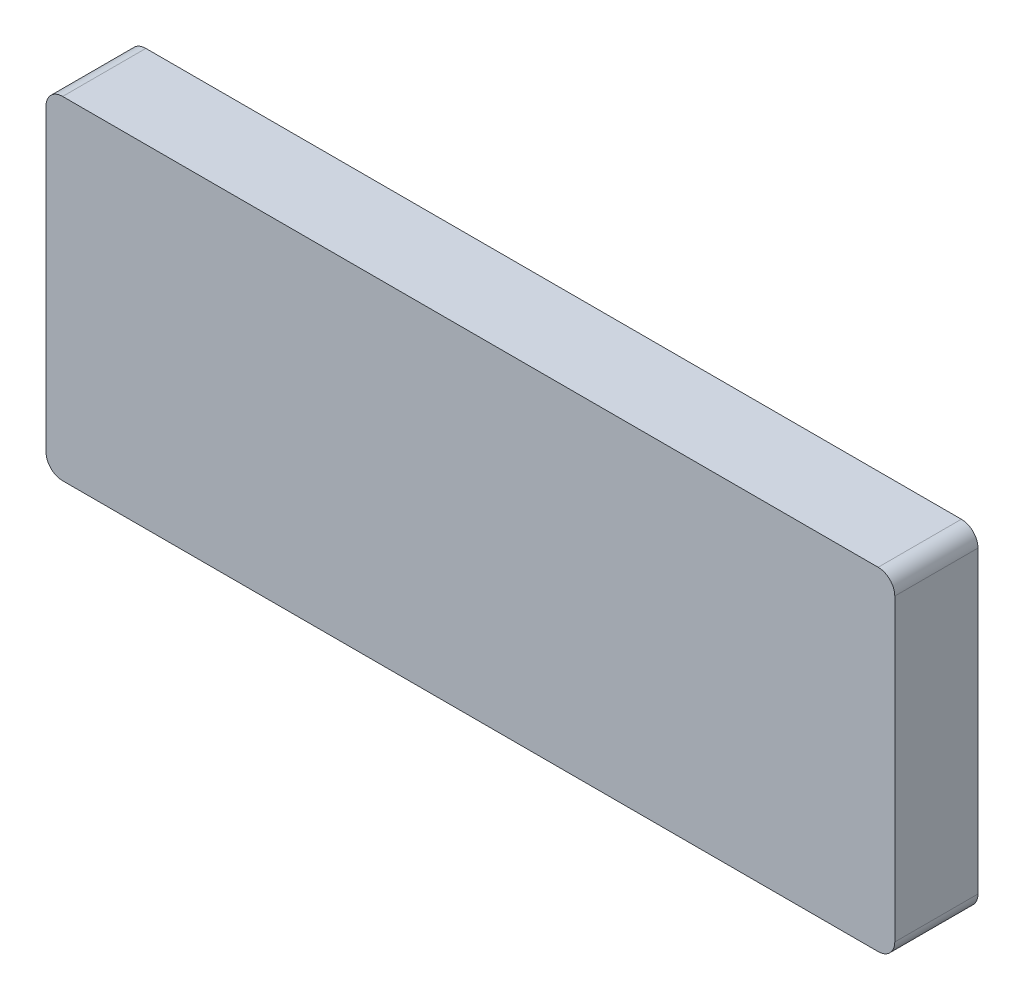
ISO-10303-21;
HEADER;
FILE_DESCRIPTION(('STEP AP214'),'2;1');
FILE_NAME('part.step','',(''),(''),'','','');
FILE_SCHEMA(('AUTOMOTIVE_DESIGN { 1 0 10303 214 1 1 1 1 }'));
ENDSEC;
DATA;
#1=APPLICATION_CONTEXT('core data for automotive mechanical design processes');
#2=APPLICATION_PROTOCOL_DEFINITION('international standard','automotive_design',2000,#1);
#3=PRODUCT_CONTEXT('',#1,'mechanical');
#4=PRODUCT('Part','Part','',(#3));
#5=PRODUCT_RELATED_PRODUCT_CATEGORY('part','',(#4));
#6=PRODUCT_DEFINITION_FORMATION('','',#4);
#7=PRODUCT_DEFINITION_CONTEXT('part definition',#1,'design');
#8=PRODUCT_DEFINITION('design','',#6,#7);
#9=PRODUCT_DEFINITION_SHAPE('','',#8);
#10=(LENGTH_UNIT() NAMED_UNIT(*) SI_UNIT(.MILLI.,.METRE.));
#11=(NAMED_UNIT(*) PLANE_ANGLE_UNIT() SI_UNIT($,.RADIAN.));
#12=(NAMED_UNIT(*) SI_UNIT($,.STERADIAN.) SOLID_ANGLE_UNIT());
#13=UNCERTAINTY_MEASURE_WITH_UNIT(LENGTH_MEASURE(1.E-05),#10,'distance_accuracy_value','');
#14=(GEOMETRIC_REPRESENTATION_CONTEXT(3) GLOBAL_UNCERTAINTY_ASSIGNED_CONTEXT((#13)) GLOBAL_UNIT_ASSIGNED_CONTEXT((#10,
#11,#12)) REPRESENTATION_CONTEXT('',''));
#15=CARTESIAN_POINT('',(0.,0.,0.));
#16=DIRECTION('',(0.,0.,1.));
#17=DIRECTION('',(1.,0.,0.));
#18=AXIS2_PLACEMENT_3D('',#15,#16,#17);
#19=CARTESIAN_POINT('',(25.,9.,5.));
#20=DIRECTION('',(0.,0.,-1.));
#21=DIRECTION('',(-1.,0.,0.));
#22=AXIS2_PLACEMENT_3D('',#19,#20,#21);
#23=CYLINDRICAL_SURFACE('',#22,1.);
#24=CARTESIAN_POINT('',(25.,9.,0.));
#25=DIRECTION('',(0.,0.,1.));
#26=DIRECTION('',(-1.,0.,0.));
#27=AXIS2_PLACEMENT_3D('',#24,#25,#26);
#28=CIRCLE('',#27,1.);
#29=CARTESIAN_POINT('',(26.,8.99999999999999,0.));
#30=VERTEX_POINT('',#29);
#31=CARTESIAN_POINT('',(25.,10.,0.));
#32=VERTEX_POINT('',#31);
#33=EDGE_CURVE('E128',#30,#32,#28,.T.);
#34=ORIENTED_EDGE('',*,*,#33,.T.);
#35=DIRECTION('',(0.,0.,-1.));
#36=VECTOR('',#35,1.);
#37=CARTESIAN_POINT('',(25.,10.,5.));
#38=LINE('',#37,#36);
#39=CARTESIAN_POINT('',(25.,10.,5.));
#40=VERTEX_POINT('',#39);
#41=EDGE_CURVE('E11',#40,#32,#38,.T.);
#42=ORIENTED_EDGE('',*,*,#41,.F.);
#43=CARTESIAN_POINT('',(25.,9.,5.));
#44=DIRECTION('',(0.,0.,1.));
#45=DIRECTION('',(-1.,0.,0.));
#46=AXIS2_PLACEMENT_3D('',#43,#44,#45);
#47=CIRCLE('',#46,1.);
#48=CARTESIAN_POINT('',(26.,8.99999999999999,5.));
#49=VERTEX_POINT('',#48);
#50=EDGE_CURVE('E142',#49,#40,#47,.T.);
#51=ORIENTED_EDGE('',*,*,#50,.F.);
#52=DIRECTION('',(0.,0.,-1.));
#53=VECTOR('',#52,1.);
#54=CARTESIAN_POINT('',(26.,8.99999999999999,5.));
#55=LINE('',#54,#53);
#56=EDGE_CURVE('E124',#49,#30,#55,.T.);
#57=ORIENTED_EDGE('',*,*,#56,.T.);
#58=EDGE_LOOP('',(#34,#42,#51,#57));
#59=FACE_BOUND('',#58,.T.);
#60=ADVANCED_FACE('F32',(#59),#23,.T.);
#61=CARTESIAN_POINT('',(-24.,10.,5.));
#62=DIRECTION('',(0.,-1.,0.));
#63=DIRECTION('',(0.,0.,-1.));
#64=AXIS2_PLACEMENT_3D('',#61,#62,#63);
#65=PLANE('',#64);
#66=DIRECTION('',(-1.,0.,0.));
#67=VECTOR('',#66,1.);
#68=CARTESIAN_POINT('',(-24.,10.,0.));
#69=LINE('',#68,#67);
#70=CARTESIAN_POINT('',(-24.,10.,0.));
#71=VERTEX_POINT('',#70);
#72=EDGE_CURVE('E131',#32,#71,#69,.T.);
#73=ORIENTED_EDGE('',*,*,#72,.T.);
#74=DIRECTION('',(0.,0.,-1.));
#75=VECTOR('',#74,1.);
#76=CARTESIAN_POINT('',(-24.,10.,5.));
#77=LINE('',#76,#75);
#78=CARTESIAN_POINT('',(-24.,10.,5.));
#79=VERTEX_POINT('',#78);
#80=EDGE_CURVE('E40',#79,#71,#77,.T.);
#81=ORIENTED_EDGE('',*,*,#80,.F.);
#82=DIRECTION('',(-1.,0.,0.));
#83=VECTOR('',#82,1.);
#84=CARTESIAN_POINT('',(-24.,10.,5.));
#85=LINE('',#84,#83);
#86=EDGE_CURVE('E91',#40,#79,#85,.T.);
#87=ORIENTED_EDGE('',*,*,#86,.F.);
#88=ORIENTED_EDGE('',*,*,#41,.T.);
#89=EDGE_LOOP('',(#73,#81,#87,#88));
#90=FACE_BOUND('',#89,.T.);
#91=ADVANCED_FACE('F177',(#90),#65,.F.);
#92=CARTESIAN_POINT('',(-24.,9.,5.));
#93=DIRECTION('',(0.,0.,-1.));
#94=DIRECTION('',(-1.,0.,0.));
#95=AXIS2_PLACEMENT_3D('',#92,#93,#94);
#96=CYLINDRICAL_SURFACE('',#95,1.);
#97=CARTESIAN_POINT('',(-24.,9.,0.));
#98=DIRECTION('',(0.,0.,1.));
#99=DIRECTION('',(1.,0.,0.));
#100=AXIS2_PLACEMENT_3D('',#97,#98,#99);
#101=CIRCLE('',#100,1.);
#102=CARTESIAN_POINT('',(-25.,8.99999999999999,0.));
#103=VERTEX_POINT('',#102);
#104=EDGE_CURVE('E133',#71,#103,#101,.T.);
#105=ORIENTED_EDGE('',*,*,#104,.T.);
#106=DIRECTION('',(0.,0.,-1.));
#107=VECTOR('',#106,1.);
#108=CARTESIAN_POINT('',(-25.,8.99999999999999,5.));
#109=LINE('',#108,#107);
#110=CARTESIAN_POINT('',(-25.,8.99999999999999,5.));
#111=VERTEX_POINT('',#110);
#112=EDGE_CURVE('E149',#111,#103,#109,.T.);
#113=ORIENTED_EDGE('',*,*,#112,.F.);
#114=CARTESIAN_POINT('',(-24.,9.,5.));
#115=DIRECTION('',(0.,0.,1.));
#116=DIRECTION('',(1.,0.,0.));
#117=AXIS2_PLACEMENT_3D('',#114,#115,#116);
#118=CIRCLE('',#117,1.);
#119=EDGE_CURVE('E157',#79,#111,#118,.T.);
#120=ORIENTED_EDGE('',*,*,#119,.F.);
#121=ORIENTED_EDGE('',*,*,#80,.T.);
#122=EDGE_LOOP('',(#105,#113,#120,#121));
#123=FACE_BOUND('',#122,.T.);
#124=ADVANCED_FACE('F155',(#123),#96,.T.);
#125=CARTESIAN_POINT('',(-25.,8.99999999999999,5.));
#126=DIRECTION('',(1.,0.,0.));
#127=DIRECTION('',(0.,0.,-1.));
#128=AXIS2_PLACEMENT_3D('',#125,#126,#127);
#129=PLANE('',#128);
#130=DIRECTION('',(0.,-1.,0.));
#131=VECTOR('',#130,1.);
#132=CARTESIAN_POINT('',(-25.,8.99999999999999,0.));
#133=LINE('',#132,#131);
#134=CARTESIAN_POINT('',(-25.,-8.99999999999999,0.));
#135=VERTEX_POINT('',#134);
#136=EDGE_CURVE('E135',#103,#135,#133,.T.);
#137=ORIENTED_EDGE('',*,*,#136,.T.);
#138=DIRECTION('',(0.,0.,-1.));
#139=VECTOR('',#138,1.);
#140=CARTESIAN_POINT('',(-25.,-8.99999999999999,5.));
#141=LINE('',#140,#139);
#142=CARTESIAN_POINT('',(-25.,-8.99999999999999,5.));
#143=VERTEX_POINT('',#142);
#144=EDGE_CURVE('E146',#143,#135,#141,.T.);
#145=ORIENTED_EDGE('',*,*,#144,.F.);
#146=DIRECTION('',(0.,-1.,0.));
#147=VECTOR('',#146,1.);
#148=CARTESIAN_POINT('',(-25.,8.99999999999999,5.));
#149=LINE('',#148,#147);
#150=EDGE_CURVE('E169',#111,#143,#149,.T.);
#151=ORIENTED_EDGE('',*,*,#150,.F.);
#152=ORIENTED_EDGE('',*,*,#112,.T.);
#153=EDGE_LOOP('',(#137,#145,#151,#152));
#154=FACE_BOUND('',#153,.T.);
#155=ADVANCED_FACE('F165',(#154),#129,.F.);
#156=CARTESIAN_POINT('',(-24.,-9.,5.));
#157=DIRECTION('',(0.,0.,-1.));
#158=DIRECTION('',(-1.,0.,0.));
#159=AXIS2_PLACEMENT_3D('',#156,#157,#158);
#160=CYLINDRICAL_SURFACE('',#159,1.);
#161=CARTESIAN_POINT('',(-24.,-9.,0.));
#162=DIRECTION('',(0.,0.,1.));
#163=DIRECTION('',(-1.,0.,0.));
#164=AXIS2_PLACEMENT_3D('',#161,#162,#163);
#165=CIRCLE('',#164,1.);
#166=CARTESIAN_POINT('',(-24.,-10.,0.));
#167=VERTEX_POINT('',#166);
#168=EDGE_CURVE('E137',#135,#167,#165,.T.);
#169=ORIENTED_EDGE('',*,*,#168,.T.);
#170=DIRECTION('',(0.,0.,-1.));
#171=VECTOR('',#170,1.);
#172=CARTESIAN_POINT('',(-24.,-10.,5.));
#173=LINE('',#172,#171);
#174=CARTESIAN_POINT('',(-24.,-10.,5.));
#175=VERTEX_POINT('',#174);
#176=EDGE_CURVE('E119',#175,#167,#173,.T.);
#177=ORIENTED_EDGE('',*,*,#176,.F.);
#178=CARTESIAN_POINT('',(-24.,-9.,5.));
#179=DIRECTION('',(0.,0.,1.));
#180=DIRECTION('',(-1.,0.,0.));
#181=AXIS2_PLACEMENT_3D('',#178,#179,#180);
#182=CIRCLE('',#181,1.);
#183=EDGE_CURVE('E110',#143,#175,#182,.T.);
#184=ORIENTED_EDGE('',*,*,#183,.F.);
#185=ORIENTED_EDGE('',*,*,#144,.T.);
#186=EDGE_LOOP('',(#169,#177,#184,#185));
#187=FACE_BOUND('',#186,.T.);
#188=ADVANCED_FACE('F168',(#187),#160,.T.);
#189=CARTESIAN_POINT('',(-24.,-10.,5.));
#190=DIRECTION('',(0.,1.,0.));
#191=DIRECTION('',(0.,0.,1.));
#192=AXIS2_PLACEMENT_3D('',#189,#190,#191);
#193=PLANE('',#192);
#194=DIRECTION('',(1.,0.,0.));
#195=VECTOR('',#194,1.);
#196=CARTESIAN_POINT('',(-24.,-10.,0.));
#197=LINE('',#196,#195);
#198=CARTESIAN_POINT('',(25.,-10.,0.));
#199=VERTEX_POINT('',#198);
#200=EDGE_CURVE('E118',#167,#199,#197,.T.);
#201=ORIENTED_EDGE('',*,*,#200,.T.);
#202=DIRECTION('',(0.,0.,-1.));
#203=VECTOR('',#202,1.);
#204=CARTESIAN_POINT('',(25.,-10.,5.));
#205=LINE('',#204,#203);
#206=CARTESIAN_POINT('',(25.,-10.,5.));
#207=VERTEX_POINT('',#206);
#208=EDGE_CURVE('E115',#207,#199,#205,.T.);
#209=ORIENTED_EDGE('',*,*,#208,.F.);
#210=DIRECTION('',(1.,0.,0.));
#211=VECTOR('',#210,1.);
#212=CARTESIAN_POINT('',(-24.,-10.,5.));
#213=LINE('',#212,#211);
#214=EDGE_CURVE('E104',#175,#207,#213,.T.);
#215=ORIENTED_EDGE('',*,*,#214,.F.);
#216=ORIENTED_EDGE('',*,*,#176,.T.);
#217=EDGE_LOOP('',(#201,#209,#215,#216));
#218=FACE_BOUND('',#217,.T.);
#219=ADVANCED_FACE('F116',(#218),#193,.F.);
#220=CARTESIAN_POINT('',(25.,-9.,5.));
#221=DIRECTION('',(0.,0.,-1.));
#222=DIRECTION('',(-1.,0.,0.));
#223=AXIS2_PLACEMENT_3D('',#220,#221,#222);
#224=CYLINDRICAL_SURFACE('',#223,1.);
#225=CARTESIAN_POINT('',(25.,-9.,0.));
#226=DIRECTION('',(0.,0.,1.));
#227=DIRECTION('',(-1.,0.,0.));
#228=AXIS2_PLACEMENT_3D('',#225,#226,#227);
#229=CIRCLE('',#228,1.);
#230=CARTESIAN_POINT('',(26.,-8.99999999999999,0.));
#231=VERTEX_POINT('',#230);
#232=EDGE_CURVE('E77',#199,#231,#229,.T.);
#233=ORIENTED_EDGE('',*,*,#232,.T.);
#234=DIRECTION('',(0.,0.,-1.));
#235=VECTOR('',#234,1.);
#236=CARTESIAN_POINT('',(26.,-8.99999999999999,5.));
#237=LINE('',#236,#235);
#238=CARTESIAN_POINT('',(26.,-8.99999999999999,5.));
#239=VERTEX_POINT('',#238);
#240=EDGE_CURVE('E120',#239,#231,#237,.T.);
#241=ORIENTED_EDGE('',*,*,#240,.F.);
#242=CARTESIAN_POINT('',(25.,-9.,5.));
#243=DIRECTION('',(0.,0.,1.));
#244=DIRECTION('',(-1.,0.,0.));
#245=AXIS2_PLACEMENT_3D('',#242,#243,#244);
#246=CIRCLE('',#245,1.);
#247=EDGE_CURVE('E108',#207,#239,#246,.T.);
#248=ORIENTED_EDGE('',*,*,#247,.F.);
#249=ORIENTED_EDGE('',*,*,#208,.T.);
#250=EDGE_LOOP('',(#233,#241,#248,#249));
#251=FACE_BOUND('',#250,.T.);
#252=ADVANCED_FACE('F122',(#251),#224,.T.);
#253=CARTESIAN_POINT('',(26.,8.99999999999999,5.));
#254=DIRECTION('',(-1.,0.,0.));
#255=DIRECTION('',(0.,0.,1.));
#256=AXIS2_PLACEMENT_3D('',#253,#254,#255);
#257=PLANE('',#256);
#258=DIRECTION('',(0.,1.,0.));
#259=VECTOR('',#258,1.);
#260=CARTESIAN_POINT('',(26.,8.99999999999999,0.));
#261=LINE('',#260,#259);
#262=EDGE_CURVE('E83',#231,#30,#261,.T.);
#263=ORIENTED_EDGE('',*,*,#262,.T.);
#264=ORIENTED_EDGE('',*,*,#56,.F.);
#265=DIRECTION('',(0.,1.,0.));
#266=VECTOR('',#265,1.);
#267=CARTESIAN_POINT('',(26.,8.99999999999999,5.));
#268=LINE('',#267,#266);
#269=EDGE_CURVE('E48',#239,#49,#268,.T.);
#270=ORIENTED_EDGE('',*,*,#269,.F.);
#271=ORIENTED_EDGE('',*,*,#240,.T.);
#272=EDGE_LOOP('',(#263,#264,#270,#271));
#273=FACE_BOUND('',#272,.T.);
#274=ADVANCED_FACE('F193',(#273),#257,.F.);
#275=CARTESIAN_POINT('',(25.,9.,5.));
#276=DIRECTION('',(0.,0.,-1.));
#277=DIRECTION('',(-1.,0.,0.));
#278=AXIS2_PLACEMENT_3D('',#275,#276,#277);
#279=PLANE('',#278);
#280=ORIENTED_EDGE('',*,*,#50,.T.);
#281=ORIENTED_EDGE('',*,*,#86,.T.);
#282=ORIENTED_EDGE('',*,*,#119,.T.);
#283=ORIENTED_EDGE('',*,*,#150,.T.);
#284=ORIENTED_EDGE('',*,*,#183,.T.);
#285=ORIENTED_EDGE('',*,*,#214,.T.);
#286=ORIENTED_EDGE('',*,*,#247,.T.);
#287=ORIENTED_EDGE('',*,*,#269,.T.);
#288=EDGE_LOOP('',(#280,#281,#282,#283,#284,#285,#286,#287));
#289=FACE_BOUND('',#288,.T.);
#290=ADVANCED_FACE('F106',(#289),#279,.F.);
#291=CARTESIAN_POINT('',(25.,9.,0.));
#292=DIRECTION('',(0.,0.,-1.));
#293=DIRECTION('',(-1.,0.,0.));
#294=AXIS2_PLACEMENT_3D('',#291,#292,#293);
#295=PLANE('',#294);
#296=ORIENTED_EDGE('',*,*,#33,.F.);
#297=ORIENTED_EDGE('',*,*,#262,.F.);
#298=ORIENTED_EDGE('',*,*,#232,.F.);
#299=ORIENTED_EDGE('',*,*,#200,.F.);
#300=ORIENTED_EDGE('',*,*,#168,.F.);
#301=ORIENTED_EDGE('',*,*,#136,.F.);
#302=ORIENTED_EDGE('',*,*,#104,.F.);
#303=ORIENTED_EDGE('',*,*,#72,.F.);
#304=EDGE_LOOP('',(#296,#297,#298,#299,#300,#301,#302,#303));
#305=FACE_BOUND('',#304,.T.);
#306=ADVANCED_FACE('F161',(#305),#295,.T.);
#307=CLOSED_SHELL('',(#60,#91,#124,#155,#188,#219,#252,#274,#290,#306));
#308=MANIFOLD_SOLID_BREP('B2',#307);
#309=ADVANCED_BREP_SHAPE_REPRESENTATION('',(#18,#308),#14);
#310=SHAPE_DEFINITION_REPRESENTATION(#9,#309);
ENDSEC;
END-ISO-10303-21;
